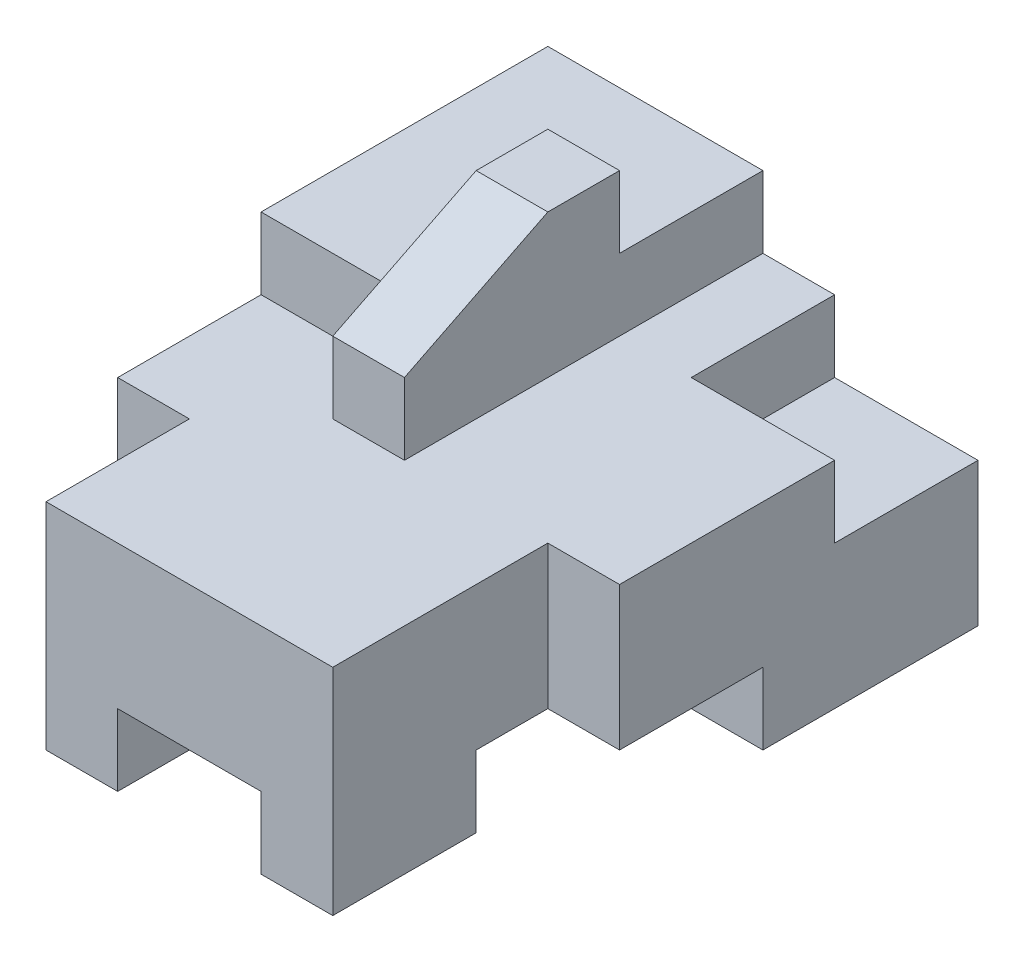
ISO-10303-21;
HEADER;
FILE_DESCRIPTION(('STEP AP214'),'2;1');
FILE_NAME('part.step','',(''),(''),'','','');
FILE_SCHEMA(('AUTOMOTIVE_DESIGN { 1 0 10303 214 1 1 1 1 }'));
ENDSEC;
DATA;
#1=APPLICATION_CONTEXT('core data for automotive mechanical design processes');
#2=APPLICATION_PROTOCOL_DEFINITION('international standard','automotive_design',2000,#1);
#3=PRODUCT_CONTEXT('',#1,'mechanical');
#4=PRODUCT('Part','Part','',(#3));
#5=PRODUCT_RELATED_PRODUCT_CATEGORY('part','',(#4));
#6=PRODUCT_DEFINITION_FORMATION('','',#4);
#7=PRODUCT_DEFINITION_CONTEXT('part definition',#1,'design');
#8=PRODUCT_DEFINITION('design','',#6,#7);
#9=PRODUCT_DEFINITION_SHAPE('','',#8);
#10=(LENGTH_UNIT() NAMED_UNIT(*) SI_UNIT(.MILLI.,.METRE.));
#11=(NAMED_UNIT(*) PLANE_ANGLE_UNIT() SI_UNIT($,.RADIAN.));
#12=(NAMED_UNIT(*) SI_UNIT($,.STERADIAN.) SOLID_ANGLE_UNIT());
#13=UNCERTAINTY_MEASURE_WITH_UNIT(LENGTH_MEASURE(1.E-05),#10,'distance_accuracy_value','');
#14=(GEOMETRIC_REPRESENTATION_CONTEXT(3) GLOBAL_UNCERTAINTY_ASSIGNED_CONTEXT((#13)) GLOBAL_UNIT_ASSIGNED_CONTEXT((#10,
#11,#12)) REPRESENTATION_CONTEXT('',''));
#15=CARTESIAN_POINT('',(0.,0.,0.));
#16=DIRECTION('',(0.,0.,1.));
#17=DIRECTION('',(1.,0.,0.));
#18=AXIS2_PLACEMENT_3D('',#15,#16,#17);
#19=CARTESIAN_POINT('',(3.,2.,8.));
#20=DIRECTION('',(0.,-1.,0.));
#21=DIRECTION('',(1.,0.,0.));
#22=AXIS2_PLACEMENT_3D('',#19,#20,#21);
#23=PLANE('',#22);
#24=DIRECTION('',(0.,0.,1.));
#25=VECTOR('',#24,1.);
#26=CARTESIAN_POINT('',(-1.,2.,5.));
#27=LINE('',#26,#25);
#28=CARTESIAN_POINT('',(-1.,2.,2.));
#29=VERTEX_POINT('',#28);
#30=CARTESIAN_POINT('',(-1.,2.,4.));
#31=VERTEX_POINT('',#30);
#32=EDGE_CURVE('E449',#29,#31,#27,.T.);
#33=ORIENTED_EDGE('',*,*,#32,.F.);
#34=DIRECTION('',(-1.,0.,0.));
#35=VECTOR('',#34,1.);
#36=CARTESIAN_POINT('',(-1.,2.,2.));
#37=LINE('',#36,#35);
#38=CARTESIAN_POINT('',(0.,2.,2.));
#39=VERTEX_POINT('',#38);
#40=EDGE_CURVE('E56',#39,#29,#37,.T.);
#41=ORIENTED_EDGE('',*,*,#40,.F.);
#42=DIRECTION('',(0.,0.,-1.));
#43=VECTOR('',#42,1.);
#44=CARTESIAN_POINT('',(0.,2.,0.));
#45=LINE('',#44,#43);
#46=CARTESIAN_POINT('',(0.,2.,0.));
#47=VERTEX_POINT('',#46);
#48=EDGE_CURVE('E410',#39,#47,#45,.T.);
#49=ORIENTED_EDGE('',*,*,#48,.T.);
#50=DIRECTION('',(-1.,0.,0.));
#51=VECTOR('',#50,1.);
#52=CARTESIAN_POINT('',(3.,2.,0.));
#53=LINE('',#52,#51);
#54=CARTESIAN_POINT('',(-3.,2.,0.));
#55=VERTEX_POINT('',#54);
#56=EDGE_CURVE('E391',#47,#55,#53,.T.);
#57=ORIENTED_EDGE('',*,*,#56,.T.);
#58=DIRECTION('',(0.,0.,-1.));
#59=VECTOR('',#58,1.);
#60=CARTESIAN_POINT('',(-3.,2.,8.));
#61=LINE('',#60,#59);
#62=CARTESIAN_POINT('',(-3.,2.,4.));
#63=VERTEX_POINT('',#62);
#64=EDGE_CURVE('E381',#63,#55,#61,.T.);
#65=ORIENTED_EDGE('',*,*,#64,.F.);
#66=DIRECTION('',(1.,0.,0.));
#67=VECTOR('',#66,1.);
#68=CARTESIAN_POINT('',(-1.,2.,4.));
#69=LINE('',#68,#67);
#70=EDGE_CURVE('E413',#63,#31,#69,.T.);
#71=ORIENTED_EDGE('',*,*,#70,.T.);
#72=EDGE_LOOP('',(#33,#41,#49,#57,#65,#71));
#73=FACE_BOUND('',#72,.T.);
#74=ADVANCED_FACE('F34',(#73),#23,.F.);
#75=CARTESIAN_POINT('',(-3.,-2.,8.));
#76=DIRECTION('',(1.,0.,0.));
#77=DIRECTION('',(0.,0.,-1.));
#78=AXIS2_PLACEMENT_3D('',#75,#76,#77);
#79=PLANE('',#78);
#80=DIRECTION('',(0.,-1.,0.));
#81=VECTOR('',#80,1.);
#82=CARTESIAN_POINT('',(-3.,-2.,0.));
#83=LINE('',#82,#81);
#84=CARTESIAN_POINT('',(-3.,-2.,0.));
#85=VERTEX_POINT('',#84);
#86=EDGE_CURVE('E365',#55,#85,#83,.T.);
#87=ORIENTED_EDGE('',*,*,#86,.T.);
#88=DIRECTION('',(0.,0.,-1.));
#89=VECTOR('',#88,1.);
#90=CARTESIAN_POINT('',(-3.,-2.,8.));
#91=LINE('',#90,#89);
#92=CARTESIAN_POINT('',(-3.,-2.,3.));
#93=VERTEX_POINT('',#92);
#94=EDGE_CURVE('E397',#93,#85,#91,.T.);
#95=ORIENTED_EDGE('',*,*,#94,.F.);
#96=DIRECTION('',(0.,1.,0.));
#97=VECTOR('',#96,1.);
#98=CARTESIAN_POINT('',(-3.,-2.,3.));
#99=LINE('',#98,#97);
#100=CARTESIAN_POINT('',(-3.,-1.,3.));
#101=VERTEX_POINT('',#100);
#102=EDGE_CURVE('E282',#93,#101,#99,.T.);
#103=ORIENTED_EDGE('',*,*,#102,.T.);
#104=DIRECTION('',(0.,0.,1.));
#105=VECTOR('',#104,1.);
#106=CARTESIAN_POINT('',(-3.,-1.,3.));
#107=LINE('',#106,#105);
#108=CARTESIAN_POINT('',(-3.,-1.,6.));
#109=VERTEX_POINT('',#108);
#110=EDGE_CURVE('E285',#101,#109,#107,.T.);
#111=ORIENTED_EDGE('',*,*,#110,.T.);
#112=DIRECTION('',(0.,1.,0.));
#113=VECTOR('',#112,1.);
#114=CARTESIAN_POINT('',(-3.,-2.,6.));
#115=LINE('',#114,#113);
#116=CARTESIAN_POINT('',(-3.,1.,6.));
#117=VERTEX_POINT('',#116);
#118=EDGE_CURVE('E335',#109,#117,#115,.T.);
#119=ORIENTED_EDGE('',*,*,#118,.T.);
#120=DIRECTION('',(0.,0.,1.));
#121=VECTOR('',#120,1.);
#122=CARTESIAN_POINT('',(-3.,1.,8.));
#123=LINE('',#122,#121);
#124=CARTESIAN_POINT('',(-3.,1.,4.));
#125=VERTEX_POINT('',#124);
#126=EDGE_CURVE('E279',#125,#117,#123,.T.);
#127=ORIENTED_EDGE('',*,*,#126,.F.);
#128=DIRECTION('',(0.,1.,0.));
#129=VECTOR('',#128,1.);
#130=CARTESIAN_POINT('',(-3.,1.,4.));
#131=LINE('',#130,#129);
#132=EDGE_CURVE('E262',#125,#63,#131,.T.);
#133=ORIENTED_EDGE('',*,*,#132,.T.);
#134=ORIENTED_EDGE('',*,*,#64,.T.);
#135=EDGE_LOOP('',(#87,#95,#103,#111,#119,#127,#133,#134));
#136=FACE_BOUND('',#135,.T.);
#137=ADVANCED_FACE('F36',(#136),#79,.F.);
#138=CARTESIAN_POINT('',(3.,-2.,8.));
#139=DIRECTION('',(-1.,0.,0.));
#140=DIRECTION('',(0.,0.,1.));
#141=AXIS2_PLACEMENT_3D('',#138,#139,#140);
#142=PLANE('',#141);
#143=DIRECTION('',(0.,0.,-1.));
#144=VECTOR('',#143,1.);
#145=CARTESIAN_POINT('',(3.,0.,2.));
#146=LINE('',#145,#144);
#147=CARTESIAN_POINT('',(3.,0.,2.));
#148=VERTEX_POINT('',#147);
#149=CARTESIAN_POINT('',(3.,0.,0.));
#150=VERTEX_POINT('',#149);
#151=EDGE_CURVE('E435',#148,#150,#146,.T.);
#152=ORIENTED_EDGE('',*,*,#151,.F.);
#153=DIRECTION('',(0.,1.,0.));
#154=VECTOR('',#153,1.);
#155=CARTESIAN_POINT('',(3.,0.,2.));
#156=LINE('',#155,#154);
#157=CARTESIAN_POINT('',(3.,1.,2.));
#158=VERTEX_POINT('',#157);
#159=EDGE_CURVE('E430',#148,#158,#156,.T.);
#160=ORIENTED_EDGE('',*,*,#159,.T.);
#161=DIRECTION('',(0.,0.,-1.));
#162=VECTOR('',#161,1.);
#163=CARTESIAN_POINT('',(3.,1.,8.));
#164=LINE('',#163,#162);
#165=CARTESIAN_POINT('',(3.,1.,5.));
#166=VERTEX_POINT('',#165);
#167=EDGE_CURVE('E270',#166,#158,#164,.T.);
#168=ORIENTED_EDGE('',*,*,#167,.F.);
#169=DIRECTION('',(0.,1.,0.));
#170=VECTOR('',#169,1.);
#171=CARTESIAN_POINT('',(3.,-2.,5.));
#172=LINE('',#171,#170);
#173=CARTESIAN_POINT('',(3.,-1.,5.));
#174=VERTEX_POINT('',#173);
#175=EDGE_CURVE('E322',#174,#166,#172,.T.);
#176=ORIENTED_EDGE('',*,*,#175,.F.);
#177=DIRECTION('',(0.,0.,1.));
#178=VECTOR('',#177,1.);
#179=CARTESIAN_POINT('',(3.,-1.,3.));
#180=LINE('',#179,#178);
#181=CARTESIAN_POINT('',(3.,-1.,3.));
#182=VERTEX_POINT('',#181);
#183=EDGE_CURVE('E286',#182,#174,#180,.T.);
#184=ORIENTED_EDGE('',*,*,#183,.F.);
#185=DIRECTION('',(0.,1.,0.));
#186=VECTOR('',#185,1.);
#187=CARTESIAN_POINT('',(3.,-2.,3.));
#188=LINE('',#187,#186);
#189=CARTESIAN_POINT('',(3.,-2.,3.));
#190=VERTEX_POINT('',#189);
#191=EDGE_CURVE('E281',#190,#182,#188,.T.);
#192=ORIENTED_EDGE('',*,*,#191,.F.);
#193=DIRECTION('',(0.,0.,-1.));
#194=VECTOR('',#193,1.);
#195=CARTESIAN_POINT('',(3.,-2.,8.));
#196=LINE('',#195,#194);
#197=CARTESIAN_POINT('',(3.,-2.,0.));
#198=VERTEX_POINT('',#197);
#199=EDGE_CURVE('E395',#190,#198,#196,.T.);
#200=ORIENTED_EDGE('',*,*,#199,.T.);
#201=DIRECTION('',(0.,1.,0.));
#202=VECTOR('',#201,1.);
#203=CARTESIAN_POINT('',(3.,-2.,0.));
#204=LINE('',#203,#202);
#205=EDGE_CURVE('E388',#198,#150,#204,.T.);
#206=ORIENTED_EDGE('',*,*,#205,.T.);
#207=EDGE_LOOP('',(#152,#160,#168,#176,#184,#192,#200,#206));
#208=FACE_BOUND('',#207,.T.);
#209=ADVANCED_FACE('F559',(#208),#142,.F.);
#210=CARTESIAN_POINT('',(0.,0.,8.));
#211=DIRECTION('',(0.,0.,1.));
#212=DIRECTION('',(1.,0.,0.));
#213=AXIS2_PLACEMENT_3D('',#210,#211,#212);
#214=PLANE('',#213);
#215=DIRECTION('',(0.,1.,0.));
#216=VECTOR('',#215,1.);
#217=CARTESIAN_POINT('',(2.,-2.,8.));
#218=LINE('',#217,#216);
#219=CARTESIAN_POINT('',(2.,-2.,8.));
#220=VERTEX_POINT('',#219);
#221=CARTESIAN_POINT('',(2.,1.,8.));
#222=VERTEX_POINT('',#221);
#223=EDGE_CURVE('E323',#220,#222,#218,.T.);
#224=ORIENTED_EDGE('',*,*,#223,.T.);
#225=DIRECTION('',(-1.,0.,0.));
#226=VECTOR('',#225,1.);
#227=CARTESIAN_POINT('',(0.,1.,8.));
#228=LINE('',#227,#226);
#229=CARTESIAN_POINT('',(-2.,1.,8.));
#230=VERTEX_POINT('',#229);
#231=EDGE_CURVE('E267',#222,#230,#228,.T.);
#232=ORIENTED_EDGE('',*,*,#231,.T.);
#233=DIRECTION('',(0.,1.,0.));
#234=VECTOR('',#233,1.);
#235=CARTESIAN_POINT('',(-2.,-2.,8.));
#236=LINE('',#235,#234);
#237=CARTESIAN_POINT('',(-2.,-2.,8.));
#238=VERTEX_POINT('',#237);
#239=EDGE_CURVE('E334',#238,#230,#236,.T.);
#240=ORIENTED_EDGE('',*,*,#239,.F.);
#241=DIRECTION('',(1.,0.,0.));
#242=VECTOR('',#241,1.);
#243=CARTESIAN_POINT('',(3.,-2.,8.));
#244=LINE('',#243,#242);
#245=CARTESIAN_POINT('',(-1.,-2.,8.));
#246=VERTEX_POINT('',#245);
#247=EDGE_CURVE('E378',#238,#246,#244,.T.);
#248=ORIENTED_EDGE('',*,*,#247,.T.);
#249=DIRECTION('',(0.,-1.,0.));
#250=VECTOR('',#249,1.);
#251=CARTESIAN_POINT('',(-1.,-2.,8.));
#252=LINE('',#251,#250);
#253=CARTESIAN_POINT('',(-1.,-1.,8.));
#254=VERTEX_POINT('',#253);
#255=EDGE_CURVE('E348',#254,#246,#252,.T.);
#256=ORIENTED_EDGE('',*,*,#255,.F.);
#257=DIRECTION('',(-1.,0.,0.));
#258=VECTOR('',#257,1.);
#259=CARTESIAN_POINT('',(-1.,-1.,8.));
#260=LINE('',#259,#258);
#261=CARTESIAN_POINT('',(0.999999999999999,-1.,8.));
#262=VERTEX_POINT('',#261);
#263=EDGE_CURVE('E357',#262,#254,#260,.T.);
#264=ORIENTED_EDGE('',*,*,#263,.F.);
#265=DIRECTION('',(0.,1.,0.));
#266=VECTOR('',#265,1.);
#267=CARTESIAN_POINT('',(0.999999999999999,-1.,8.));
#268=LINE('',#267,#266);
#269=CARTESIAN_POINT('',(0.999999999999999,-2.,8.));
#270=VERTEX_POINT('',#269);
#271=EDGE_CURVE('E338',#270,#262,#268,.T.);
#272=ORIENTED_EDGE('',*,*,#271,.F.);
#273=EDGE_CURVE('E382',#270,#220,#244,.T.);
#274=ORIENTED_EDGE('',*,*,#273,.T.);
#275=EDGE_LOOP('',(#224,#232,#240,#248,#256,#264,#272,#274));
#276=FACE_BOUND('',#275,.T.);
#277=ADVANCED_FACE('F524',(#276),#214,.T.);
#278=CARTESIAN_POINT('',(-2.,-2.,6.));
#279=DIRECTION('',(0.,0.,-1.));
#280=DIRECTION('',(-1.,0.,0.));
#281=AXIS2_PLACEMENT_3D('',#278,#279,#280);
#282=PLANE('',#281);
#283=DIRECTION('',(1.,0.,0.));
#284=VECTOR('',#283,1.);
#285=CARTESIAN_POINT('',(-2.,1.,6.));
#286=LINE('',#285,#284);
#287=CARTESIAN_POINT('',(-2.,1.,6.));
#288=VERTEX_POINT('',#287);
#289=EDGE_CURVE('E275',#117,#288,#286,.T.);
#290=ORIENTED_EDGE('',*,*,#289,.F.);
#291=ORIENTED_EDGE('',*,*,#118,.F.);
#292=DIRECTION('',(1.,0.,0.));
#293=VECTOR('',#292,1.);
#294=CARTESIAN_POINT('',(-3.,-1.,6.));
#295=LINE('',#294,#293);
#296=CARTESIAN_POINT('',(-2.,-1.,6.));
#297=VERTEX_POINT('',#296);
#298=EDGE_CURVE('E297',#109,#297,#295,.T.);
#299=ORIENTED_EDGE('',*,*,#298,.T.);
#300=DIRECTION('',(0.,1.,0.));
#301=VECTOR('',#300,1.);
#302=CARTESIAN_POINT('',(-2.,-2.,6.));
#303=LINE('',#302,#301);
#304=EDGE_CURVE('E341',#297,#288,#303,.T.);
#305=ORIENTED_EDGE('',*,*,#304,.T.);
#306=EDGE_LOOP('',(#290,#291,#299,#305));
#307=FACE_BOUND('',#306,.T.);
#308=ADVANCED_FACE('F510',(#307),#282,.F.);
#309=CARTESIAN_POINT('',(-2.,-2.,8.));
#310=DIRECTION('',(1.,0.,0.));
#311=DIRECTION('',(0.,1.,0.));
#312=AXIS2_PLACEMENT_3D('',#309,#310,#311);
#313=PLANE('',#312);
#314=DIRECTION('',(0.,0.,1.));
#315=VECTOR('',#314,1.);
#316=CARTESIAN_POINT('',(-2.,1.,8.));
#317=LINE('',#316,#315);
#318=EDGE_CURVE('E273',#288,#230,#317,.T.);
#319=ORIENTED_EDGE('',*,*,#318,.F.);
#320=ORIENTED_EDGE('',*,*,#304,.F.);
#321=CARTESIAN_POINT('',(-2.,-2.,6.));
#322=VERTEX_POINT('',#321);
#323=EDGE_CURVE('E339',#322,#297,#303,.T.);
#324=ORIENTED_EDGE('',*,*,#323,.F.);
#325=DIRECTION('',(0.,0.,-1.));
#326=VECTOR('',#325,1.);
#327=CARTESIAN_POINT('',(-2.,-2.,8.));
#328=LINE('',#327,#326);
#329=EDGE_CURVE('E326',#238,#322,#328,.T.);
#330=ORIENTED_EDGE('',*,*,#329,.F.);
#331=ORIENTED_EDGE('',*,*,#239,.T.);
#332=EDGE_LOOP('',(#319,#320,#324,#330,#331));
#333=FACE_BOUND('',#332,.T.);
#334=ADVANCED_FACE('F519',(#333),#313,.F.);
#335=CARTESIAN_POINT('',(2.,-2.,8.));
#336=DIRECTION('',(-1.,0.,0.));
#337=DIRECTION('',(0.,-1.,0.));
#338=AXIS2_PLACEMENT_3D('',#335,#336,#337);
#339=PLANE('',#338);
#340=DIRECTION('',(0.,0.,-1.));
#341=VECTOR('',#340,1.);
#342=CARTESIAN_POINT('',(2.,1.,8.));
#343=LINE('',#342,#341);
#344=CARTESIAN_POINT('',(2.,1.,5.));
#345=VERTEX_POINT('',#344);
#346=EDGE_CURVE('E256',#222,#345,#343,.T.);
#347=ORIENTED_EDGE('',*,*,#346,.F.);
#348=ORIENTED_EDGE('',*,*,#223,.F.);
#349=DIRECTION('',(0.,0.,1.));
#350=VECTOR('',#349,1.);
#351=CARTESIAN_POINT('',(2.,-2.,8.));
#352=LINE('',#351,#350);
#353=CARTESIAN_POINT('',(2.,-2.,6.));
#354=VERTEX_POINT('',#353);
#355=EDGE_CURVE('E320',#354,#220,#352,.T.);
#356=ORIENTED_EDGE('',*,*,#355,.F.);
#357=DIRECTION('',(0.,1.,0.));
#358=VECTOR('',#357,1.);
#359=CARTESIAN_POINT('',(2.,-2.,6.));
#360=LINE('',#359,#358);
#361=CARTESIAN_POINT('',(2.,-1.,6.));
#362=VERTEX_POINT('',#361);
#363=EDGE_CURVE('E403',#354,#362,#360,.T.);
#364=ORIENTED_EDGE('',*,*,#363,.T.);
#365=DIRECTION('',(0.,0.,-1.));
#366=VECTOR('',#365,1.);
#367=CARTESIAN_POINT('',(2.,-1.,8.));
#368=LINE('',#367,#366);
#369=CARTESIAN_POINT('',(2.,-1.,5.));
#370=VERTEX_POINT('',#369);
#371=EDGE_CURVE('E308',#362,#370,#368,.T.);
#372=ORIENTED_EDGE('',*,*,#371,.T.);
#373=DIRECTION('',(0.,1.,0.));
#374=VECTOR('',#373,1.);
#375=CARTESIAN_POINT('',(2.,-2.,5.));
#376=LINE('',#375,#374);
#377=EDGE_CURVE('E327',#370,#345,#376,.T.);
#378=ORIENTED_EDGE('',*,*,#377,.T.);
#379=EDGE_LOOP('',(#347,#348,#356,#364,#372,#378));
#380=FACE_BOUND('',#379,.T.);
#381=ADVANCED_FACE('F549',(#380),#339,.F.);
#382=CARTESIAN_POINT('',(2.,-2.,5.));
#383=DIRECTION('',(0.,0.,-1.));
#384=DIRECTION('',(-1.,0.,0.));
#385=AXIS2_PLACEMENT_3D('',#382,#383,#384);
#386=PLANE('',#385);
#387=DIRECTION('',(1.,0.,0.));
#388=VECTOR('',#387,1.);
#389=CARTESIAN_POINT('',(2.,1.,5.));
#390=LINE('',#389,#388);
#391=EDGE_CURVE('E42',#345,#166,#390,.T.);
#392=ORIENTED_EDGE('',*,*,#391,.F.);
#393=ORIENTED_EDGE('',*,*,#377,.F.);
#394=DIRECTION('',(1.,0.,0.));
#395=VECTOR('',#394,1.);
#396=CARTESIAN_POINT('',(2.,-1.,5.));
#397=LINE('',#396,#395);
#398=EDGE_CURVE('E400',#370,#174,#397,.T.);
#399=ORIENTED_EDGE('',*,*,#398,.T.);
#400=ORIENTED_EDGE('',*,*,#175,.T.);
#401=EDGE_LOOP('',(#392,#393,#399,#400));
#402=FACE_BOUND('',#401,.T.);
#403=ADVANCED_FACE('F554',(#402),#386,.F.);
#404=CARTESIAN_POINT('',(3.,-2.,8.));
#405=DIRECTION('',(0.,1.,0.));
#406=DIRECTION('',(-1.,0.,0.));
#407=AXIS2_PLACEMENT_3D('',#404,#405,#406);
#408=PLANE('',#407);
#409=ORIENTED_EDGE('',*,*,#329,.T.);
#410=DIRECTION('',(1.,0.,0.));
#411=VECTOR('',#410,1.);
#412=CARTESIAN_POINT('',(-3.,-2.,6.));
#413=LINE('',#412,#411);
#414=CARTESIAN_POINT('',(-1.,-2.,6.));
#415=VERTEX_POINT('',#414);
#416=EDGE_CURVE('E296',#322,#415,#413,.T.);
#417=ORIENTED_EDGE('',*,*,#416,.T.);
#418=DIRECTION('',(0.,0.,1.));
#419=VECTOR('',#418,1.);
#420=CARTESIAN_POINT('',(-1.,-2.,0.));
#421=LINE('',#420,#419);
#422=EDGE_CURVE('E366',#415,#246,#421,.T.);
#423=ORIENTED_EDGE('',*,*,#422,.T.);
#424=ORIENTED_EDGE('',*,*,#247,.F.);
#425=EDGE_LOOP('',(#409,#417,#423,#424));
#426=FACE_BOUND('',#425,.T.);
#427=ADVANCED_FACE('F527',(#426),#408,.F.);
#428=DIRECTION('',(0.,0.,1.));
#429=VECTOR('',#428,1.);
#430=CARTESIAN_POINT('',(0.999999999999999,-2.,0.));
#431=LINE('',#430,#429);
#432=CARTESIAN_POINT('',(0.999999999999999,-2.,6.));
#433=VERTEX_POINT('',#432);
#434=EDGE_CURVE('E354',#433,#270,#431,.T.);
#435=ORIENTED_EDGE('',*,*,#434,.F.);
#436=EDGE_CURVE('E293',#433,#354,#413,.T.);
#437=ORIENTED_EDGE('',*,*,#436,.T.);
#438=ORIENTED_EDGE('',*,*,#355,.T.);
#439=ORIENTED_EDGE('',*,*,#273,.F.);
#440=EDGE_LOOP('',(#435,#437,#438,#439));
#441=FACE_BOUND('',#440,.T.);
#442=ADVANCED_FACE('F544',(#441),#408,.F.);
#443=CARTESIAN_POINT('',(-1.,-2.,0.));
#444=DIRECTION('',(-1.,0.,0.));
#445=DIRECTION('',(0.,0.,1.));
#446=AXIS2_PLACEMENT_3D('',#443,#444,#445);
#447=PLANE('',#446);
#448=ORIENTED_EDGE('',*,*,#422,.F.);
#449=DIRECTION('',(0.,1.,0.));
#450=VECTOR('',#449,1.);
#451=CARTESIAN_POINT('',(-1.,-2.,6.));
#452=LINE('',#451,#450);
#453=CARTESIAN_POINT('',(-1.,-1.,6.));
#454=VERTEX_POINT('',#453);
#455=EDGE_CURVE('E314',#415,#454,#452,.T.);
#456=ORIENTED_EDGE('',*,*,#455,.T.);
#457=DIRECTION('',(0.,0.,1.));
#458=VECTOR('',#457,1.);
#459=CARTESIAN_POINT('',(-1.,-1.,0.));
#460=LINE('',#459,#458);
#461=EDGE_CURVE('E370',#454,#254,#460,.T.);
#462=ORIENTED_EDGE('',*,*,#461,.T.);
#463=ORIENTED_EDGE('',*,*,#255,.T.);
#464=EDGE_LOOP('',(#448,#456,#462,#463));
#465=FACE_BOUND('',#464,.T.);
#466=ADVANCED_FACE('F531',(#465),#447,.F.);
#467=CARTESIAN_POINT('',(0.999999999999999,-1.,0.));
#468=DIRECTION('',(1.,0.,0.));
#469=DIRECTION('',(0.,0.,-1.));
#470=AXIS2_PLACEMENT_3D('',#467,#468,#469);
#471=PLANE('',#470);
#472=DIRECTION('',(0.,0.,1.));
#473=VECTOR('',#472,1.);
#474=CARTESIAN_POINT('',(0.999999999999999,-1.,0.));
#475=LINE('',#474,#473);
#476=CARTESIAN_POINT('',(0.999999999999999,-1.,6.));
#477=VERTEX_POINT('',#476);
#478=EDGE_CURVE('E374',#477,#262,#475,.T.);
#479=ORIENTED_EDGE('',*,*,#478,.F.);
#480=DIRECTION('',(0.,-1.,0.));
#481=VECTOR('',#480,1.);
#482=CARTESIAN_POINT('',(0.999999999999999,-1.,6.));
#483=LINE('',#482,#481);
#484=EDGE_CURVE('E311',#477,#433,#483,.T.);
#485=ORIENTED_EDGE('',*,*,#484,.T.);
#486=ORIENTED_EDGE('',*,*,#434,.T.);
#487=ORIENTED_EDGE('',*,*,#271,.T.);
#488=EDGE_LOOP('',(#479,#485,#486,#487));
#489=FACE_BOUND('',#488,.T.);
#490=ADVANCED_FACE('F541',(#489),#471,.F.);
#491=CARTESIAN_POINT('',(-1.,-2.,0.));
#492=VERTEX_POINT('',#491);
#493=CARTESIAN_POINT('',(-1.,-2.,3.));
#494=VERTEX_POINT('',#493);
#495=EDGE_CURVE('E362',#492,#494,#421,.T.);
#496=ORIENTED_EDGE('',*,*,#495,.T.);
#497=DIRECTION('',(1.,0.,0.));
#498=VECTOR('',#497,1.);
#499=CARTESIAN_POINT('',(-3.,-2.,3.));
#500=LINE('',#499,#498);
#501=EDGE_CURVE('E306',#93,#494,#500,.T.);
#502=ORIENTED_EDGE('',*,*,#501,.F.);
#503=ORIENTED_EDGE('',*,*,#94,.T.);
#504=DIRECTION('',(1.,0.,0.));
#505=VECTOR('',#504,1.);
#506=CARTESIAN_POINT('',(3.,-2.,0.));
#507=LINE('',#506,#505);
#508=EDGE_CURVE('E385',#85,#492,#507,.T.);
#509=ORIENTED_EDGE('',*,*,#508,.T.);
#510=EDGE_LOOP('',(#496,#502,#503,#509));
#511=FACE_BOUND('',#510,.T.);
#512=ADVANCED_FACE('F495',(#511),#408,.F.);
#513=ORIENTED_EDGE('',*,*,#199,.F.);
#514=CARTESIAN_POINT('',(0.999999999999999,-2.,3.));
#515=VERTEX_POINT('',#514);
#516=EDGE_CURVE('E289',#515,#190,#500,.T.);
#517=ORIENTED_EDGE('',*,*,#516,.F.);
#518=CARTESIAN_POINT('',(0.999999999999999,-2.,0.));
#519=VERTEX_POINT('',#518);
#520=EDGE_CURVE('E375',#519,#515,#431,.T.);
#521=ORIENTED_EDGE('',*,*,#520,.F.);
#522=EDGE_CURVE('E384',#519,#198,#507,.T.);
#523=ORIENTED_EDGE('',*,*,#522,.T.);
#524=EDGE_LOOP('',(#513,#517,#521,#523));
#525=FACE_BOUND('',#524,.T.);
#526=ADVANCED_FACE('F589',(#525),#408,.F.);
#527=CARTESIAN_POINT('',(0.,0.,0.));
#528=DIRECTION('',(0.,0.,1.));
#529=DIRECTION('',(1.,0.,0.));
#530=AXIS2_PLACEMENT_3D('',#527,#528,#529);
#531=PLANE('',#530);
#532=DIRECTION('',(-1.,0.,0.));
#533=VECTOR('',#532,1.);
#534=CARTESIAN_POINT('',(0.,1.,0.));
#535=LINE('',#534,#533);
#536=CARTESIAN_POINT('',(0.999999999999999,1.,0.));
#537=VERTEX_POINT('',#536);
#538=CARTESIAN_POINT('',(0.,1.,0.));
#539=VERTEX_POINT('',#538);
#540=EDGE_CURVE('E277',#537,#539,#535,.T.);
#541=ORIENTED_EDGE('',*,*,#540,.F.);
#542=DIRECTION('',(0.,1.,0.));
#543=VECTOR('',#542,1.);
#544=CARTESIAN_POINT('',(1.,0.,0.));
#545=LINE('',#544,#543);
#546=CARTESIAN_POINT('',(1.,0.,0.));
#547=VERTEX_POINT('',#546);
#548=EDGE_CURVE('E425',#547,#537,#545,.T.);
#549=ORIENTED_EDGE('',*,*,#548,.F.);
#550=DIRECTION('',(-1.,0.,0.));
#551=VECTOR('',#550,1.);
#552=CARTESIAN_POINT('',(3.,0.,0.));
#553=LINE('',#552,#551);
#554=EDGE_CURVE('E445',#150,#547,#553,.T.);
#555=ORIENTED_EDGE('',*,*,#554,.F.);
#556=ORIENTED_EDGE('',*,*,#205,.F.);
#557=ORIENTED_EDGE('',*,*,#522,.F.);
#558=DIRECTION('',(0.,1.,0.));
#559=VECTOR('',#558,1.);
#560=CARTESIAN_POINT('',(0.999999999999999,-1.,0.));
#561=LINE('',#560,#559);
#562=CARTESIAN_POINT('',(0.999999999999999,-1.,0.));
#563=VERTEX_POINT('',#562);
#564=EDGE_CURVE('E344',#519,#563,#561,.T.);
#565=ORIENTED_EDGE('',*,*,#564,.T.);
#566=DIRECTION('',(-1.,0.,0.));
#567=VECTOR('',#566,1.);
#568=CARTESIAN_POINT('',(-1.,-1.,0.));
#569=LINE('',#568,#567);
#570=CARTESIAN_POINT('',(-1.,-1.,0.));
#571=VERTEX_POINT('',#570);
#572=EDGE_CURVE('E347',#563,#571,#569,.T.);
#573=ORIENTED_EDGE('',*,*,#572,.T.);
#574=DIRECTION('',(0.,-1.,0.));
#575=VECTOR('',#574,1.);
#576=CARTESIAN_POINT('',(-1.,-2.,0.));
#577=LINE('',#576,#575);
#578=EDGE_CURVE('E351',#571,#492,#577,.T.);
#579=ORIENTED_EDGE('',*,*,#578,.T.);
#580=ORIENTED_EDGE('',*,*,#508,.F.);
#581=ORIENTED_EDGE('',*,*,#86,.F.);
#582=ORIENTED_EDGE('',*,*,#56,.F.);
#583=DIRECTION('',(0.,1.,0.));
#584=VECTOR('',#583,1.);
#585=CARTESIAN_POINT('',(0.,1.,0.));
#586=LINE('',#585,#584);
#587=EDGE_CURVE('E252',#539,#47,#586,.T.);
#588=ORIENTED_EDGE('',*,*,#587,.F.);
#589=EDGE_LOOP('',(#541,#549,#555,#556,#557,#565,#573,#579,#580,#581,#582,#588));
#590=FACE_BOUND('',#589,.T.);
#591=ADVANCED_FACE('F490',(#590),#531,.F.);
#592=CARTESIAN_POINT('',(-1.,-1.,3.));
#593=VERTEX_POINT('',#592);
#594=EDGE_CURVE('E367',#571,#593,#460,.T.);
#595=ORIENTED_EDGE('',*,*,#594,.T.);
#596=DIRECTION('',(0.,-1.,0.));
#597=VECTOR('',#596,1.);
#598=CARTESIAN_POINT('',(-1.,-2.,3.));
#599=LINE('',#598,#597);
#600=EDGE_CURVE('E317',#593,#494,#599,.T.);
#601=ORIENTED_EDGE('',*,*,#600,.T.);
#602=ORIENTED_EDGE('',*,*,#495,.F.);
#603=ORIENTED_EDGE('',*,*,#578,.F.);
#604=EDGE_LOOP('',(#595,#601,#602,#603));
#605=FACE_BOUND('',#604,.T.);
#606=ADVANCED_FACE('F499',(#605),#447,.F.);
#607=CARTESIAN_POINT('',(-1.,-1.,0.));
#608=DIRECTION('',(0.,1.,0.));
#609=DIRECTION('',(0.,0.,1.));
#610=AXIS2_PLACEMENT_3D('',#607,#608,#609);
#611=PLANE('',#610);
#612=CARTESIAN_POINT('',(0.999999999999999,-1.,3.));
#613=VERTEX_POINT('',#612);
#614=EDGE_CURVE('E371',#563,#613,#475,.T.);
#615=ORIENTED_EDGE('',*,*,#614,.T.);
#616=DIRECTION('',(1.,0.,0.));
#617=VECTOR('',#616,1.);
#618=CARTESIAN_POINT('',(-3.,-1.,3.));
#619=LINE('',#618,#617);
#620=EDGE_CURVE('E305',#613,#182,#619,.T.);
#621=ORIENTED_EDGE('',*,*,#620,.T.);
#622=ORIENTED_EDGE('',*,*,#183,.T.);
#623=ORIENTED_EDGE('',*,*,#398,.F.);
#624=ORIENTED_EDGE('',*,*,#371,.F.);
#625=EDGE_CURVE('E301',#477,#362,#295,.T.);
#626=ORIENTED_EDGE('',*,*,#625,.F.);
#627=ORIENTED_EDGE('',*,*,#478,.T.);
#628=ORIENTED_EDGE('',*,*,#263,.T.);
#629=ORIENTED_EDGE('',*,*,#461,.F.);
#630=EDGE_CURVE('E300',#297,#454,#295,.T.);
#631=ORIENTED_EDGE('',*,*,#630,.F.);
#632=ORIENTED_EDGE('',*,*,#298,.F.);
#633=ORIENTED_EDGE('',*,*,#110,.F.);
#634=EDGE_CURVE('E302',#101,#593,#619,.T.);
#635=ORIENTED_EDGE('',*,*,#634,.T.);
#636=ORIENTED_EDGE('',*,*,#594,.F.);
#637=ORIENTED_EDGE('',*,*,#572,.F.);
#638=EDGE_LOOP('',(#615,#621,#622,#623,#624,#626,#627,#628,#629,#631,#632,#633,#635,#636,#637));
#639=FACE_BOUND('',#638,.T.);
#640=ADVANCED_FACE('F502',(#639),#611,.F.);
#641=ORIENTED_EDGE('',*,*,#520,.T.);
#642=DIRECTION('',(0.,1.,0.));
#643=VECTOR('',#642,1.);
#644=CARTESIAN_POINT('',(0.999999999999999,-1.,3.));
#645=LINE('',#644,#643);
#646=EDGE_CURVE('E406',#515,#613,#645,.T.);
#647=ORIENTED_EDGE('',*,*,#646,.T.);
#648=ORIENTED_EDGE('',*,*,#614,.F.);
#649=ORIENTED_EDGE('',*,*,#564,.F.);
#650=EDGE_LOOP('',(#641,#647,#648,#649));
#651=FACE_BOUND('',#650,.T.);
#652=ADVANCED_FACE('F617',(#651),#471,.F.);
#653=CARTESIAN_POINT('',(-3.,-1.,6.));
#654=DIRECTION('',(0.,0.,1.));
#655=DIRECTION('',(1.,0.,0.));
#656=AXIS2_PLACEMENT_3D('',#653,#654,#655);
#657=PLANE('',#656);
#658=ORIENTED_EDGE('',*,*,#625,.T.);
#659=ORIENTED_EDGE('',*,*,#363,.F.);
#660=ORIENTED_EDGE('',*,*,#436,.F.);
#661=ORIENTED_EDGE('',*,*,#484,.F.);
#662=EDGE_LOOP('',(#658,#659,#660,#661));
#663=FACE_BOUND('',#662,.T.);
#664=ADVANCED_FACE('F619',(#663),#657,.F.);
#665=CARTESIAN_POINT('',(-3.,-2.,3.));
#666=DIRECTION('',(0.,0.,-1.));
#667=DIRECTION('',(-1.,0.,0.));
#668=AXIS2_PLACEMENT_3D('',#665,#666,#667);
#669=PLANE('',#668);
#670=ORIENTED_EDGE('',*,*,#516,.T.);
#671=ORIENTED_EDGE('',*,*,#191,.T.);
#672=ORIENTED_EDGE('',*,*,#620,.F.);
#673=ORIENTED_EDGE('',*,*,#646,.F.);
#674=EDGE_LOOP('',(#670,#671,#672,#673));
#675=FACE_BOUND('',#674,.T.);
#676=ADVANCED_FACE('F761',(#675),#669,.F.);
#677=ORIENTED_EDGE('',*,*,#634,.F.);
#678=ORIENTED_EDGE('',*,*,#102,.F.);
#679=ORIENTED_EDGE('',*,*,#501,.T.);
#680=ORIENTED_EDGE('',*,*,#600,.F.);
#681=EDGE_LOOP('',(#677,#678,#679,#680));
#682=FACE_BOUND('',#681,.T.);
#683=ADVANCED_FACE('F497',(#682),#669,.F.);
#684=ORIENTED_EDGE('',*,*,#416,.F.);
#685=ORIENTED_EDGE('',*,*,#323,.T.);
#686=ORIENTED_EDGE('',*,*,#630,.T.);
#687=ORIENTED_EDGE('',*,*,#455,.F.);
#688=EDGE_LOOP('',(#684,#685,#686,#687));
#689=FACE_BOUND('',#688,.T.);
#690=ADVANCED_FACE('F666',(#689),#657,.F.);
#691=CARTESIAN_POINT('',(0.,1.,4.));
#692=DIRECTION('',(0.,1.,0.));
#693=DIRECTION('',(-1.,0.,0.));
#694=AXIS2_PLACEMENT_3D('',#691,#692,#693);
#695=PLANE('',#694);
#696=DIRECTION('',(1.,0.,0.));
#697=VECTOR('',#696,1.);
#698=CARTESIAN_POINT('',(1.,1.,2.));
#699=LINE('',#698,#697);
#700=CARTESIAN_POINT('',(1.,1.,2.));
#701=VERTEX_POINT('',#700);
#702=EDGE_CURVE('E433',#701,#158,#699,.T.);
#703=ORIENTED_EDGE('',*,*,#702,.F.);
#704=DIRECTION('',(0.,0.,1.));
#705=VECTOR('',#704,1.);
#706=CARTESIAN_POINT('',(0.999999999999999,1.,0.));
#707=LINE('',#706,#705);
#708=EDGE_CURVE('E436',#537,#701,#707,.T.);
#709=ORIENTED_EDGE('',*,*,#708,.F.);
#710=ORIENTED_EDGE('',*,*,#540,.T.);
#711=DIRECTION('',(0.,0.,-1.));
#712=VECTOR('',#711,1.);
#713=CARTESIAN_POINT('',(0.,1.,0.));
#714=LINE('',#713,#712);
#715=CARTESIAN_POINT('',(0.,1.,5.));
#716=VERTEX_POINT('',#715);
#717=EDGE_CURVE('E265',#716,#539,#714,.T.);
#718=ORIENTED_EDGE('',*,*,#717,.F.);
#719=DIRECTION('',(1.,0.,0.));
#720=VECTOR('',#719,1.);
#721=CARTESIAN_POINT('',(0.,1.,5.));
#722=LINE('',#721,#720);
#723=CARTESIAN_POINT('',(-1.,1.,5.));
#724=VERTEX_POINT('',#723);
#725=EDGE_CURVE('E251',#724,#716,#722,.T.);
#726=ORIENTED_EDGE('',*,*,#725,.F.);
#727=DIRECTION('',(0.,0.,1.));
#728=VECTOR('',#727,1.);
#729=CARTESIAN_POINT('',(-1.,1.,5.));
#730=LINE('',#729,#728);
#731=CARTESIAN_POINT('',(-1.,1.,4.));
#732=VERTEX_POINT('',#731);
#733=EDGE_CURVE('E420',#732,#724,#730,.T.);
#734=ORIENTED_EDGE('',*,*,#733,.F.);
#735=DIRECTION('',(1.,0.,0.));
#736=VECTOR('',#735,1.);
#737=CARTESIAN_POINT('',(-1.,1.,4.));
#738=LINE('',#737,#736);
#739=EDGE_CURVE('E412',#125,#732,#738,.T.);
#740=ORIENTED_EDGE('',*,*,#739,.F.);
#741=ORIENTED_EDGE('',*,*,#126,.T.);
#742=ORIENTED_EDGE('',*,*,#289,.T.);
#743=ORIENTED_EDGE('',*,*,#318,.T.);
#744=ORIENTED_EDGE('',*,*,#231,.F.);
#745=ORIENTED_EDGE('',*,*,#346,.T.);
#746=ORIENTED_EDGE('',*,*,#391,.T.);
#747=ORIENTED_EDGE('',*,*,#167,.T.);
#748=EDGE_LOOP('',(#703,#709,#710,#718,#726,#734,#740,#741,#742,#743,#744,#745,#746,#747));
#749=FACE_BOUND('',#748,.T.);
#750=ADVANCED_FACE('F516',(#749),#695,.T.);
#751=CARTESIAN_POINT('',(0.,1.,0.));
#752=DIRECTION('',(1.,0.,0.));
#753=DIRECTION('',(0.,1.,0.));
#754=AXIS2_PLACEMENT_3D('',#751,#752,#753);
#755=PLANE('',#754);
#756=DIRECTION('',(0.,0.447213595499958,-0.894427190999916));
#757=VECTOR('',#756,1.);
#758=CARTESIAN_POINT('',(0.,3.,3.));
#759=LINE('',#758,#757);
#760=CARTESIAN_POINT('',(0.,2.,5.));
#761=VERTEX_POINT('',#760);
#762=CARTESIAN_POINT('',(0.,3.,3.));
#763=VERTEX_POINT('',#762);
#764=EDGE_CURVE('E49',#761,#763,#759,.T.);
#765=ORIENTED_EDGE('',*,*,#764,.F.);
#766=DIRECTION('',(0.,1.,0.));
#767=VECTOR('',#766,1.);
#768=CARTESIAN_POINT('',(0.,1.,5.));
#769=LINE('',#768,#767);
#770=EDGE_CURVE('E243',#716,#761,#769,.T.);
#771=ORIENTED_EDGE('',*,*,#770,.F.);
#772=ORIENTED_EDGE('',*,*,#717,.T.);
#773=ORIENTED_EDGE('',*,*,#587,.T.);
#774=ORIENTED_EDGE('',*,*,#48,.F.);
#775=DIRECTION('',(0.,-1.,0.));
#776=VECTOR('',#775,1.);
#777=CARTESIAN_POINT('',(0.,3.,2.));
#778=LINE('',#777,#776);
#779=CARTESIAN_POINT('',(0.,3.,2.));
#780=VERTEX_POINT('',#779);
#781=EDGE_CURVE('E439',#780,#39,#778,.T.);
#782=ORIENTED_EDGE('',*,*,#781,.F.);
#783=DIRECTION('',(0.,0.,-1.));
#784=VECTOR('',#783,1.);
#785=CARTESIAN_POINT('',(0.,3.,2.));
#786=LINE('',#785,#784);
#787=EDGE_CURVE('E246',#763,#780,#786,.T.);
#788=ORIENTED_EDGE('',*,*,#787,.F.);
#789=EDGE_LOOP('',(#765,#771,#772,#773,#774,#782,#788));
#790=FACE_BOUND('',#789,.T.);
#791=ADVANCED_FACE('F241',(#790),#755,.T.);
#792=CARTESIAN_POINT('',(0.,1.,5.));
#793=DIRECTION('',(0.,0.,1.));
#794=DIRECTION('',(1.,0.,0.));
#795=AXIS2_PLACEMENT_3D('',#792,#793,#794);
#796=PLANE('',#795);
#797=DIRECTION('',(1.,0.,0.));
#798=VECTOR('',#797,1.);
#799=CARTESIAN_POINT('',(-3.000025,2.,5.));
#800=LINE('',#799,#798);
#801=CARTESIAN_POINT('',(-1.,2.,5.));
#802=VERTEX_POINT('',#801);
#803=EDGE_CURVE('E231',#802,#761,#800,.T.);
#804=ORIENTED_EDGE('',*,*,#803,.F.);
#805=DIRECTION('',(0.,1.,0.));
#806=VECTOR('',#805,1.);
#807=CARTESIAN_POINT('',(-1.,1.,5.));
#808=LINE('',#807,#806);
#809=EDGE_CURVE('E253',#724,#802,#808,.T.);
#810=ORIENTED_EDGE('',*,*,#809,.F.);
#811=ORIENTED_EDGE('',*,*,#725,.T.);
#812=ORIENTED_EDGE('',*,*,#770,.T.);
#813=EDGE_LOOP('',(#804,#810,#811,#812));
#814=FACE_BOUND('',#813,.T.);
#815=ADVANCED_FACE('F249',(#814),#796,.T.);
#816=CARTESIAN_POINT('',(-1.,1.,5.));
#817=DIRECTION('',(-1.,0.,0.));
#818=DIRECTION('',(0.,-1.,0.));
#819=AXIS2_PLACEMENT_3D('',#816,#817,#818);
#820=PLANE('',#819);
#821=DIRECTION('',(0.,-0.447213595499958,0.894427190999916));
#822=VECTOR('',#821,1.);
#823=CARTESIAN_POINT('',(-1.,1.8,5.4));
#824=LINE('',#823,#822);
#825=CARTESIAN_POINT('',(-1.,3.,3.));
#826=VERTEX_POINT('',#825);
#827=EDGE_CURVE('E234',#826,#802,#824,.T.);
#828=ORIENTED_EDGE('',*,*,#827,.F.);
#829=DIRECTION('',(0.,0.,1.));
#830=VECTOR('',#829,1.);
#831=CARTESIAN_POINT('',(-1.,3.,5.));
#832=LINE('',#831,#830);
#833=CARTESIAN_POINT('',(-1.,3.,2.));
#834=VERTEX_POINT('',#833);
#835=EDGE_CURVE('E455',#834,#826,#832,.T.);
#836=ORIENTED_EDGE('',*,*,#835,.F.);
#837=DIRECTION('',(0.,-1.,0.));
#838=VECTOR('',#837,1.);
#839=CARTESIAN_POINT('',(-1.,3.,2.));
#840=LINE('',#839,#838);
#841=EDGE_CURVE('E452',#834,#29,#840,.T.);
#842=ORIENTED_EDGE('',*,*,#841,.T.);
#843=ORIENTED_EDGE('',*,*,#32,.T.);
#844=DIRECTION('',(0.,1.,0.));
#845=VECTOR('',#844,1.);
#846=CARTESIAN_POINT('',(-1.,1.,4.));
#847=LINE('',#846,#845);
#848=EDGE_CURVE('E258',#732,#31,#847,.T.);
#849=ORIENTED_EDGE('',*,*,#848,.F.);
#850=ORIENTED_EDGE('',*,*,#733,.T.);
#851=ORIENTED_EDGE('',*,*,#809,.T.);
#852=EDGE_LOOP('',(#828,#836,#842,#843,#849,#850,#851));
#853=FACE_BOUND('',#852,.T.);
#854=ADVANCED_FACE('F479',(#853),#820,.T.);
#855=CARTESIAN_POINT('',(-1.,1.,4.));
#856=DIRECTION('',(0.,0.,1.));
#857=DIRECTION('',(1.,0.,0.));
#858=AXIS2_PLACEMENT_3D('',#855,#856,#857);
#859=PLANE('',#858);
#860=ORIENTED_EDGE('',*,*,#70,.F.);
#861=ORIENTED_EDGE('',*,*,#132,.F.);
#862=ORIENTED_EDGE('',*,*,#739,.T.);
#863=ORIENTED_EDGE('',*,*,#848,.T.);
#864=EDGE_LOOP('',(#860,#861,#862,#863));
#865=FACE_BOUND('',#864,.T.);
#866=ADVANCED_FACE('F678',(#865),#859,.T.);
#867=CARTESIAN_POINT('',(1.,0.,2.));
#868=DIRECTION('',(0.,0.,1.));
#869=DIRECTION('',(1.,0.,0.));
#870=AXIS2_PLACEMENT_3D('',#867,#868,#869);
#871=PLANE('',#870);
#872=ORIENTED_EDGE('',*,*,#702,.T.);
#873=ORIENTED_EDGE('',*,*,#159,.F.);
#874=DIRECTION('',(1.,0.,0.));
#875=VECTOR('',#874,1.);
#876=CARTESIAN_POINT('',(1.,0.,2.));
#877=LINE('',#876,#875);
#878=CARTESIAN_POINT('',(1.,0.,2.));
#879=VERTEX_POINT('',#878);
#880=EDGE_CURVE('E428',#879,#148,#877,.T.);
#881=ORIENTED_EDGE('',*,*,#880,.F.);
#882=DIRECTION('',(0.,1.,0.));
#883=VECTOR('',#882,1.);
#884=CARTESIAN_POINT('',(1.,0.,2.));
#885=LINE('',#884,#883);
#886=EDGE_CURVE('E427',#879,#701,#885,.T.);
#887=ORIENTED_EDGE('',*,*,#886,.T.);
#888=EDGE_LOOP('',(#872,#873,#881,#887));
#889=FACE_BOUND('',#888,.T.);
#890=ADVANCED_FACE('F563',(#889),#871,.F.);
#891=CARTESIAN_POINT('',(1.,0.,0.));
#892=DIRECTION('',(-1.,0.,0.));
#893=DIRECTION('',(0.,-1.,0.));
#894=AXIS2_PLACEMENT_3D('',#891,#892,#893);
#895=PLANE('',#894);
#896=ORIENTED_EDGE('',*,*,#708,.T.);
#897=ORIENTED_EDGE('',*,*,#886,.F.);
#898=DIRECTION('',(0.,0.,1.));
#899=VECTOR('',#898,1.);
#900=CARTESIAN_POINT('',(1.,0.,0.));
#901=LINE('',#900,#899);
#902=EDGE_CURVE('E442',#547,#879,#901,.T.);
#903=ORIENTED_EDGE('',*,*,#902,.F.);
#904=ORIENTED_EDGE('',*,*,#548,.T.);
#905=EDGE_LOOP('',(#896,#897,#903,#904));
#906=FACE_BOUND('',#905,.T.);
#907=ADVANCED_FACE('F566',(#906),#895,.F.);
#908=CARTESIAN_POINT('',(0.,0.,0.));
#909=DIRECTION('',(0.,1.,0.));
#910=DIRECTION('',(-1.,0.,0.));
#911=AXIS2_PLACEMENT_3D('',#908,#909,#910);
#912=PLANE('',#911);
#913=ORIENTED_EDGE('',*,*,#151,.T.);
#914=ORIENTED_EDGE('',*,*,#554,.T.);
#915=ORIENTED_EDGE('',*,*,#902,.T.);
#916=ORIENTED_EDGE('',*,*,#880,.T.);
#917=EDGE_LOOP('',(#913,#914,#915,#916));
#918=FACE_BOUND('',#917,.T.);
#919=ADVANCED_FACE('F578',(#918),#912,.T.);
#920=CARTESIAN_POINT('',(-1.,3.,2.));
#921=DIRECTION('',(0.,0.,1.));
#922=DIRECTION('',(1.,0.,0.));
#923=AXIS2_PLACEMENT_3D('',#920,#921,#922);
#924=PLANE('',#923);
#925=ORIENTED_EDGE('',*,*,#40,.T.);
#926=ORIENTED_EDGE('',*,*,#841,.F.);
#927=DIRECTION('',(-1.,0.,0.));
#928=VECTOR('',#927,1.);
#929=CARTESIAN_POINT('',(-1.,3.,2.));
#930=LINE('',#929,#928);
#931=EDGE_CURVE('E458',#780,#834,#930,.T.);
#932=ORIENTED_EDGE('',*,*,#931,.F.);
#933=ORIENTED_EDGE('',*,*,#781,.T.);
#934=EDGE_LOOP('',(#925,#926,#932,#933));
#935=FACE_BOUND('',#934,.T.);
#936=ADVANCED_FACE('F482',(#935),#924,.F.);
#937=CARTESIAN_POINT('',(0.,3.,0.));
#938=DIRECTION('',(0.,-1.,0.));
#939=DIRECTION('',(1.,0.,0.));
#940=AXIS2_PLACEMENT_3D('',#937,#938,#939);
#941=PLANE('',#940);
#942=ORIENTED_EDGE('',*,*,#835,.T.);
#943=DIRECTION('',(1.,0.,0.));
#944=VECTOR('',#943,1.);
#945=CARTESIAN_POINT('',(0.,3.,3.));
#946=LINE('',#945,#944);
#947=EDGE_CURVE('E12',#826,#763,#946,.T.);
#948=ORIENTED_EDGE('',*,*,#947,.T.);
#949=ORIENTED_EDGE('',*,*,#787,.T.);
#950=ORIENTED_EDGE('',*,*,#931,.T.);
#951=EDGE_LOOP('',(#942,#948,#949,#950));
#952=FACE_BOUND('',#951,.T.);
#953=ADVANCED_FACE('F570',(#952),#941,.F.);
#954=CARTESIAN_POINT('',(-3.000025,3.,3.));
#955=DIRECTION('',(0.,-0.894427190999916,-0.447213595499958));
#956=DIRECTION('',(0.,0.447213595499958,-0.894427190999916));
#957=AXIS2_PLACEMENT_3D('',#954,#955,#956);
#958=PLANE('',#957);
#959=ORIENTED_EDGE('',*,*,#827,.T.);
#960=ORIENTED_EDGE('',*,*,#803,.T.);
#961=ORIENTED_EDGE('',*,*,#764,.T.);
#962=ORIENTED_EDGE('',*,*,#947,.F.);
#963=EDGE_LOOP('',(#959,#960,#961,#962));
#964=FACE_BOUND('',#963,.T.);
#965=ADVANCED_FACE('F232',(#964),#958,.F.);
#966=CLOSED_SHELL('',(#74,#137,#209,#277,#308,#334,#381,#403,#427,#442,#466,#490,#512,#526,#591,
#606,#640,#652,#664,#676,#683,#690,#750,#791,#815,#854,#866,#890,#907,#919,#936,#953,#965));
#967=MANIFOLD_SOLID_BREP('B2',#966);
#968=ADVANCED_BREP_SHAPE_REPRESENTATION('',(#18,#967),#14);
#969=SHAPE_DEFINITION_REPRESENTATION(#9,#968);
ENDSEC;
END-ISO-10303-21;
